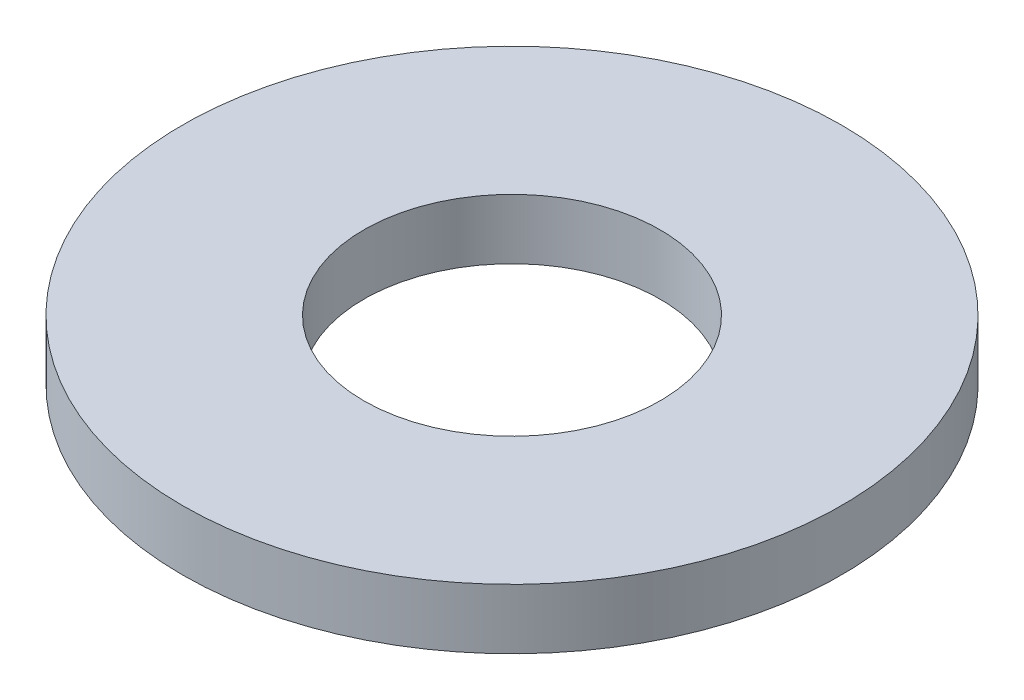
ISO-10303-21;
HEADER;
FILE_DESCRIPTION(('STEP AP214'),'2;1');
FILE_NAME('part.step','',(''),(''),'','','');
FILE_SCHEMA(('AUTOMOTIVE_DESIGN { 1 0 10303 214 1 1 1 1 }'));
ENDSEC;
DATA;
#1=APPLICATION_CONTEXT('core data for automotive mechanical design processes');
#2=APPLICATION_PROTOCOL_DEFINITION('international standard','automotive_design',2000,#1);
#3=PRODUCT_CONTEXT('',#1,'mechanical');
#4=PRODUCT('Part','Part','',(#3));
#5=PRODUCT_RELATED_PRODUCT_CATEGORY('part','',(#4));
#6=PRODUCT_DEFINITION_FORMATION('','',#4);
#7=PRODUCT_DEFINITION_CONTEXT('part definition',#1,'design');
#8=PRODUCT_DEFINITION('design','',#6,#7);
#9=PRODUCT_DEFINITION_SHAPE('','',#8);
#10=(LENGTH_UNIT() NAMED_UNIT(*) SI_UNIT(.MILLI.,.METRE.));
#11=(NAMED_UNIT(*) PLANE_ANGLE_UNIT() SI_UNIT($,.RADIAN.));
#12=(NAMED_UNIT(*) SI_UNIT($,.STERADIAN.) SOLID_ANGLE_UNIT());
#13=UNCERTAINTY_MEASURE_WITH_UNIT(LENGTH_MEASURE(1.E-05),#10,'distance_accuracy_value','');
#14=(GEOMETRIC_REPRESENTATION_CONTEXT(3) GLOBAL_UNCERTAINTY_ASSIGNED_CONTEXT((#13)) GLOBAL_UNIT_ASSIGNED_CONTEXT((#10,
#11,#12)) REPRESENTATION_CONTEXT('',''));
#15=CARTESIAN_POINT('',(0.,0.,0.));
#16=DIRECTION('',(0.,0.,1.));
#17=DIRECTION('',(1.,0.,0.));
#18=AXIS2_PLACEMENT_3D('',#15,#16,#17);
#19=CARTESIAN_POINT('',(0.,1.4478,0.));
#20=DIRECTION('',(0.,-1.,0.));
#21=DIRECTION('',(0.,0.,-1.));
#22=AXIS2_PLACEMENT_3D('',#19,#20,#21);
#23=CYLINDRICAL_SURFACE('',#22,7.9375);
#24=CARTESIAN_POINT('',(0.,1.4478,0.));
#25=DIRECTION('',(0.,1.,0.));
#26=DIRECTION('',(0.,0.,1.));
#27=AXIS2_PLACEMENT_3D('',#24,#25,#26);
#28=CIRCLE('',#27,7.9375);
#29=CARTESIAN_POINT('',(0.,1.4478,7.9375));
#30=VERTEX_POINT('',#29);
#31=EDGE_CURVE('E10',#30,#30,#28,.T.);
#32=ORIENTED_EDGE('',*,*,#31,.F.);
#33=EDGE_LOOP('',(#32));
#34=FACE_BOUND('',#33,.T.);
#35=CARTESIAN_POINT('',(0.,0.,0.));
#36=DIRECTION('',(0.,1.,0.));
#37=DIRECTION('',(0.,0.,1.));
#38=AXIS2_PLACEMENT_3D('',#35,#36,#37);
#39=CIRCLE('',#38,7.9375);
#40=CARTESIAN_POINT('',(0.,0.,7.9375));
#41=VERTEX_POINT('',#40);
#42=EDGE_CURVE('E36',#41,#41,#39,.T.);
#43=ORIENTED_EDGE('',*,*,#42,.T.);
#44=EDGE_LOOP('',(#43));
#45=FACE_BOUND('',#44,.T.);
#46=ADVANCED_FACE('F33',(#34,#45),#23,.T.);
#47=CARTESIAN_POINT('',(0.,1.4478,0.));
#48=DIRECTION('',(0.,1.,0.));
#49=DIRECTION('',(0.,0.,1.));
#50=AXIS2_PLACEMENT_3D('',#47,#48,#49);
#51=PLANE('',#50);
#52=CARTESIAN_POINT('',(0.,1.4478,0.));
#53=DIRECTION('',(0.,1.,0.));
#54=DIRECTION('',(0.,0.,1.));
#55=AXIS2_PLACEMENT_3D('',#52,#53,#54);
#56=CIRCLE('',#55,3.5687);
#57=CARTESIAN_POINT('',(0.,1.4478,3.5687));
#58=VERTEX_POINT('',#57);
#59=EDGE_CURVE('E45',#58,#58,#56,.T.);
#60=ORIENTED_EDGE('',*,*,#59,.F.);
#61=EDGE_LOOP('',(#60));
#62=FACE_BOUND('',#61,.T.);
#63=ORIENTED_EDGE('',*,*,#31,.T.);
#64=EDGE_LOOP('',(#63));
#65=FACE_BOUND('',#64,.T.);
#66=ADVANCED_FACE('F60',(#62,#65),#51,.T.);
#67=CARTESIAN_POINT('',(0.,0.,0.));
#68=DIRECTION('',(0.,1.,0.));
#69=DIRECTION('',(0.,0.,1.));
#70=AXIS2_PLACEMENT_3D('',#67,#68,#69);
#71=PLANE('',#70);
#72=CARTESIAN_POINT('',(0.,0.,0.));
#73=DIRECTION('',(0.,1.,0.));
#74=DIRECTION('',(0.,0.,1.));
#75=AXIS2_PLACEMENT_3D('',#72,#73,#74);
#76=CIRCLE('',#75,3.5687);
#77=CARTESIAN_POINT('',(0.,0.,3.5687));
#78=VERTEX_POINT('',#77);
#79=EDGE_CURVE('E43',#78,#78,#76,.T.);
#80=ORIENTED_EDGE('',*,*,#79,.T.);
#81=EDGE_LOOP('',(#80));
#82=FACE_BOUND('',#81,.T.);
#83=ORIENTED_EDGE('',*,*,#42,.F.);
#84=EDGE_LOOP('',(#83));
#85=FACE_BOUND('',#84,.T.);
#86=ADVANCED_FACE('F51',(#82,#85),#71,.F.);
#87=CARTESIAN_POINT('',(0.,0.,0.));
#88=DIRECTION('',(0.,1.,0.));
#89=DIRECTION('',(0.,0.,1.));
#90=AXIS2_PLACEMENT_3D('',#87,#88,#89);
#91=CYLINDRICAL_SURFACE('',#90,3.5687);
#92=ORIENTED_EDGE('',*,*,#79,.F.);
#93=EDGE_LOOP('',(#92));
#94=FACE_BOUND('',#93,.T.);
#95=ORIENTED_EDGE('',*,*,#59,.T.);
#96=EDGE_LOOP('',(#95));
#97=FACE_BOUND('',#96,.T.);
#98=ADVANCED_FACE('F54',(#94,#97),#91,.F.);
#99=CLOSED_SHELL('',(#46,#66,#86,#98));
#100=MANIFOLD_SOLID_BREP('B2',#99);
#101=ADVANCED_BREP_SHAPE_REPRESENTATION('',(#18,#100),#14);
#102=SHAPE_DEFINITION_REPRESENTATION(#9,#101);
ENDSEC;
END-ISO-10303-21;
